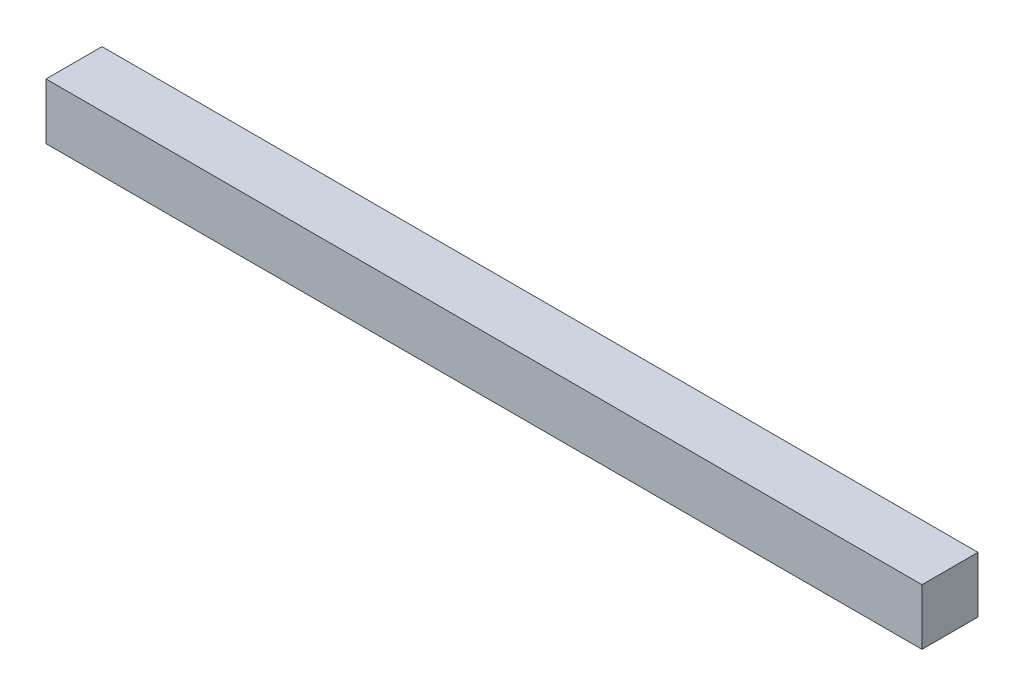
ISO-10303-21;
HEADER;
FILE_DESCRIPTION(('STEP AP214'),'2;1');
FILE_NAME('part.step','',(''),(''),'','','');
FILE_SCHEMA(('AUTOMOTIVE_DESIGN { 1 0 10303 214 1 1 1 1 }'));
ENDSEC;
DATA;
#1=APPLICATION_CONTEXT('core data for automotive mechanical design processes');
#2=APPLICATION_PROTOCOL_DEFINITION('international standard','automotive_design',2000,#1);
#3=PRODUCT_CONTEXT('',#1,'mechanical');
#4=PRODUCT('Part','Part','',(#3));
#5=PRODUCT_RELATED_PRODUCT_CATEGORY('part','',(#4));
#6=PRODUCT_DEFINITION_FORMATION('','',#4);
#7=PRODUCT_DEFINITION_CONTEXT('part definition',#1,'design');
#8=PRODUCT_DEFINITION('design','',#6,#7);
#9=PRODUCT_DEFINITION_SHAPE('','',#8);
#10=(LENGTH_UNIT() NAMED_UNIT(*) SI_UNIT(.MILLI.,.METRE.));
#11=(NAMED_UNIT(*) PLANE_ANGLE_UNIT() SI_UNIT($,.RADIAN.));
#12=(NAMED_UNIT(*) SI_UNIT($,.STERADIAN.) SOLID_ANGLE_UNIT());
#13=UNCERTAINTY_MEASURE_WITH_UNIT(LENGTH_MEASURE(1.E-05),#10,'distance_accuracy_value','');
#14=(GEOMETRIC_REPRESENTATION_CONTEXT(3) GLOBAL_UNCERTAINTY_ASSIGNED_CONTEXT((#13)) GLOBAL_UNIT_ASSIGNED_CONTEXT((#10,
#11,#12)) REPRESENTATION_CONTEXT('',''));
#15=CARTESIAN_POINT('',(0.,0.,0.));
#16=DIRECTION('',(0.,0.,1.));
#17=DIRECTION('',(1.,0.,0.));
#18=AXIS2_PLACEMENT_3D('',#15,#16,#17);
#19=CARTESIAN_POINT('',(0.,3.,0.));
#20=DIRECTION('',(1.,0.,0.));
#21=DIRECTION('',(0.,0.,-1.));
#22=AXIS2_PLACEMENT_3D('',#19,#20,#21);
#23=PLANE('',#22);
#24=DIRECTION('',(0.,0.,1.));
#25=VECTOR('',#24,1.);
#26=CARTESIAN_POINT('',(0.,0.,0.));
#27=LINE('',#26,#25);
#28=CARTESIAN_POINT('',(0.,0.,-3.));
#29=VERTEX_POINT('',#28);
#30=CARTESIAN_POINT('',(0.,0.,0.));
#31=VERTEX_POINT('',#30);
#32=EDGE_CURVE('E96',#29,#31,#27,.T.);
#33=ORIENTED_EDGE('',*,*,#32,.T.);
#34=DIRECTION('',(0.,-1.,0.));
#35=VECTOR('',#34,1.);
#36=CARTESIAN_POINT('',(0.,3.,0.));
#37=LINE('',#36,#35);
#38=CARTESIAN_POINT('',(0.,3.,0.));
#39=VERTEX_POINT('',#38);
#40=EDGE_CURVE('E11',#39,#31,#37,.T.);
#41=ORIENTED_EDGE('',*,*,#40,.F.);
#42=DIRECTION('',(0.,0.,1.));
#43=VECTOR('',#42,1.);
#44=CARTESIAN_POINT('',(0.,3.,0.));
#45=LINE('',#44,#43);
#46=CARTESIAN_POINT('',(0.,3.,-3.));
#47=VERTEX_POINT('',#46);
#48=EDGE_CURVE('E84',#47,#39,#45,.T.);
#49=ORIENTED_EDGE('',*,*,#48,.F.);
#50=DIRECTION('',(0.,-1.,0.));
#51=VECTOR('',#50,1.);
#52=CARTESIAN_POINT('',(0.,3.,-3.));
#53=LINE('',#52,#51);
#54=EDGE_CURVE('E92',#47,#29,#53,.T.);
#55=ORIENTED_EDGE('',*,*,#54,.T.);
#56=EDGE_LOOP('',(#33,#41,#49,#55));
#57=FACE_BOUND('',#56,.T.);
#58=ADVANCED_FACE('F33',(#57),#23,.F.);
#59=CARTESIAN_POINT('',(0.,3.,0.));
#60=DIRECTION('',(0.,0.,-1.));
#61=DIRECTION('',(-1.,0.,0.));
#62=AXIS2_PLACEMENT_3D('',#59,#60,#61);
#63=PLANE('',#62);
#64=DIRECTION('',(1.,0.,0.));
#65=VECTOR('',#64,1.);
#66=CARTESIAN_POINT('',(0.,0.,0.));
#67=LINE('',#66,#65);
#68=CARTESIAN_POINT('',(46.9,0.,0.));
#69=VERTEX_POINT('',#68);
#70=EDGE_CURVE('E88',#31,#69,#67,.T.);
#71=ORIENTED_EDGE('',*,*,#70,.T.);
#72=DIRECTION('',(0.,-1.,0.));
#73=VECTOR('',#72,1.);
#74=CARTESIAN_POINT('',(46.9,3.,0.));
#75=LINE('',#74,#73);
#76=CARTESIAN_POINT('',(46.9,3.,0.));
#77=VERTEX_POINT('',#76);
#78=EDGE_CURVE('E41',#77,#69,#75,.T.);
#79=ORIENTED_EDGE('',*,*,#78,.F.);
#80=DIRECTION('',(1.,0.,0.));
#81=VECTOR('',#80,1.);
#82=CARTESIAN_POINT('',(0.,3.,0.));
#83=LINE('',#82,#81);
#84=EDGE_CURVE('E79',#39,#77,#83,.T.);
#85=ORIENTED_EDGE('',*,*,#84,.F.);
#86=ORIENTED_EDGE('',*,*,#40,.T.);
#87=EDGE_LOOP('',(#71,#79,#85,#86));
#88=FACE_BOUND('',#87,.T.);
#89=ADVANCED_FACE('F87',(#88),#63,.F.);
#90=CARTESIAN_POINT('',(46.9,3.,0.));
#91=DIRECTION('',(-1.,0.,0.));
#92=DIRECTION('',(0.,0.,1.));
#93=AXIS2_PLACEMENT_3D('',#90,#91,#92);
#94=PLANE('',#93);
#95=DIRECTION('',(0.,0.,-1.));
#96=VECTOR('',#95,1.);
#97=CARTESIAN_POINT('',(46.9,0.,0.));
#98=LINE('',#97,#96);
#99=CARTESIAN_POINT('',(46.9,0.,-3.));
#100=VERTEX_POINT('',#99);
#101=EDGE_CURVE('E66',#69,#100,#98,.T.);
#102=ORIENTED_EDGE('',*,*,#101,.T.);
#103=DIRECTION('',(0.,-1.,0.));
#104=VECTOR('',#103,1.);
#105=CARTESIAN_POINT('',(46.9,3.,-3.));
#106=LINE('',#105,#104);
#107=CARTESIAN_POINT('',(46.9,3.,-3.));
#108=VERTEX_POINT('',#107);
#109=EDGE_CURVE('E89',#108,#100,#106,.T.);
#110=ORIENTED_EDGE('',*,*,#109,.F.);
#111=DIRECTION('',(0.,0.,-1.));
#112=VECTOR('',#111,1.);
#113=CARTESIAN_POINT('',(46.9,3.,0.));
#114=LINE('',#113,#112);
#115=EDGE_CURVE('E82',#77,#108,#114,.T.);
#116=ORIENTED_EDGE('',*,*,#115,.F.);
#117=ORIENTED_EDGE('',*,*,#78,.T.);
#118=EDGE_LOOP('',(#102,#110,#116,#117));
#119=FACE_BOUND('',#118,.T.);
#120=ADVANCED_FACE('F90',(#119),#94,.F.);
#121=CARTESIAN_POINT('',(0.,3.,-3.));
#122=DIRECTION('',(0.,0.,1.));
#123=DIRECTION('',(1.,0.,0.));
#124=AXIS2_PLACEMENT_3D('',#121,#122,#123);
#125=PLANE('',#124);
#126=DIRECTION('',(-1.,0.,0.));
#127=VECTOR('',#126,1.);
#128=CARTESIAN_POINT('',(0.,0.,-3.));
#129=LINE('',#128,#127);
#130=EDGE_CURVE('E72',#100,#29,#129,.T.);
#131=ORIENTED_EDGE('',*,*,#130,.T.);
#132=ORIENTED_EDGE('',*,*,#54,.F.);
#133=DIRECTION('',(-1.,0.,0.));
#134=VECTOR('',#133,1.);
#135=CARTESIAN_POINT('',(0.,3.,-3.));
#136=LINE('',#135,#134);
#137=EDGE_CURVE('E49',#108,#47,#136,.T.);
#138=ORIENTED_EDGE('',*,*,#137,.F.);
#139=ORIENTED_EDGE('',*,*,#109,.T.);
#140=EDGE_LOOP('',(#131,#132,#138,#139));
#141=FACE_BOUND('',#140,.T.);
#142=ADVANCED_FACE('F103',(#141),#125,.F.);
#143=CARTESIAN_POINT('',(0.,3.,0.));
#144=DIRECTION('',(0.,-1.,0.));
#145=DIRECTION('',(0.,0.,-1.));
#146=AXIS2_PLACEMENT_3D('',#143,#144,#145);
#147=PLANE('',#146);
#148=ORIENTED_EDGE('',*,*,#48,.T.);
#149=ORIENTED_EDGE('',*,*,#84,.T.);
#150=ORIENTED_EDGE('',*,*,#115,.T.);
#151=ORIENTED_EDGE('',*,*,#137,.T.);
#152=EDGE_LOOP('',(#148,#149,#150,#151));
#153=FACE_BOUND('',#152,.T.);
#154=ADVANCED_FACE('F80',(#153),#147,.F.);
#155=CARTESIAN_POINT('',(0.,0.,0.));
#156=DIRECTION('',(0.,-1.,0.));
#157=DIRECTION('',(0.,0.,-1.));
#158=AXIS2_PLACEMENT_3D('',#155,#156,#157);
#159=PLANE('',#158);
#160=ORIENTED_EDGE('',*,*,#32,.F.);
#161=ORIENTED_EDGE('',*,*,#130,.F.);
#162=ORIENTED_EDGE('',*,*,#101,.F.);
#163=ORIENTED_EDGE('',*,*,#70,.F.);
#164=EDGE_LOOP('',(#160,#161,#162,#163));
#165=FACE_BOUND('',#164,.T.);
#166=ADVANCED_FACE('F106',(#165),#159,.T.);
#167=CLOSED_SHELL('',(#58,#89,#120,#142,#154,#166));
#168=MANIFOLD_SOLID_BREP('B2',#167);
#169=ADVANCED_BREP_SHAPE_REPRESENTATION('',(#18,#168),#14);
#170=SHAPE_DEFINITION_REPRESENTATION(#9,#169);
ENDSEC;
END-ISO-10303-21;
